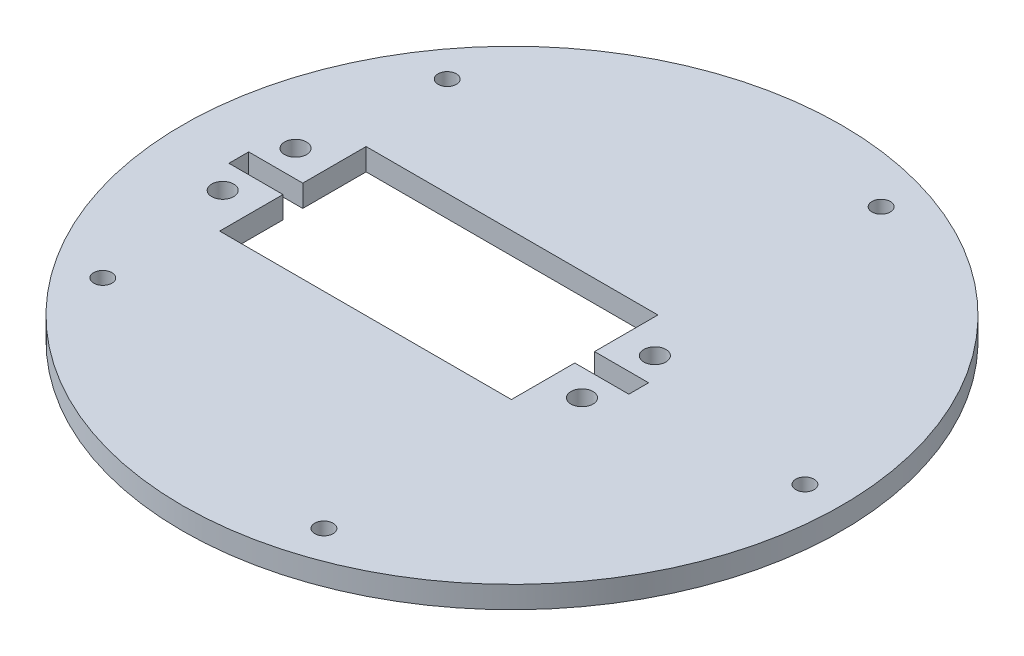
ISO-10303-21;
HEADER;
FILE_DESCRIPTION(('STEP AP214'),'2;1');
FILE_NAME('part.step','',(''),(''),'','','');
FILE_SCHEMA(('AUTOMOTIVE_DESIGN { 1 0 10303 214 1 1 1 1 }'));
ENDSEC;
DATA;
#1=APPLICATION_CONTEXT('core data for automotive mechanical design processes');
#2=APPLICATION_PROTOCOL_DEFINITION('international standard','automotive_design',2000,#1);
#3=PRODUCT_CONTEXT('',#1,'mechanical');
#4=PRODUCT('Part','Part','',(#3));
#5=PRODUCT_RELATED_PRODUCT_CATEGORY('part','',(#4));
#6=PRODUCT_DEFINITION_FORMATION('','',#4);
#7=PRODUCT_DEFINITION_CONTEXT('part definition',#1,'design');
#8=PRODUCT_DEFINITION('design','',#6,#7);
#9=PRODUCT_DEFINITION_SHAPE('','',#8);
#10=(LENGTH_UNIT() NAMED_UNIT(*) SI_UNIT(.MILLI.,.METRE.));
#11=(NAMED_UNIT(*) PLANE_ANGLE_UNIT() SI_UNIT($,.RADIAN.));
#12=(NAMED_UNIT(*) SI_UNIT($,.STERADIAN.) SOLID_ANGLE_UNIT());
#13=UNCERTAINTY_MEASURE_WITH_UNIT(LENGTH_MEASURE(1.E-05),#10,'distance_accuracy_value','');
#14=(GEOMETRIC_REPRESENTATION_CONTEXT(3) GLOBAL_UNCERTAINTY_ASSIGNED_CONTEXT((#13)) GLOBAL_UNIT_ASSIGNED_CONTEXT((#10,
#11,#12)) REPRESENTATION_CONTEXT('',''));
#15=CARTESIAN_POINT('',(0.,0.,0.));
#16=DIRECTION('',(0.,0.,1.));
#17=DIRECTION('',(1.,0.,0.));
#18=AXIS2_PLACEMENT_3D('',#15,#16,#17);
#19=CARTESIAN_POINT('',(0.,3.,0.));
#20=DIRECTION('',(0.,1.,0.));
#21=DIRECTION('',(0.,0.,1.));
#22=AXIS2_PLACEMENT_3D('',#19,#20,#21);
#23=PLANE('',#22);
#24=CARTESIAN_POINT('',(14.53,3.,-4.975));
#25=DIRECTION('',(0.,1.,0.));
#26=DIRECTION('',(0.,0.,1.));
#27=AXIS2_PLACEMENT_3D('',#24,#25,#26);
#28=CIRCLE('',#27,1.5);
#29=CARTESIAN_POINT('',(14.53,3.,-3.475));
#30=VERTEX_POINT('',#29);
#31=EDGE_CURVE('E249',#30,#30,#28,.T.);
#32=ORIENTED_EDGE('',*,*,#31,.F.);
#33=EDGE_LOOP('',(#32));
#34=FACE_BOUND('',#33,.T.);
#35=CARTESIAN_POINT('',(-34.53,3.,-4.975));
#36=DIRECTION('',(0.,1.,0.));
#37=DIRECTION('',(0.,0.,1.));
#38=AXIS2_PLACEMENT_3D('',#35,#36,#37);
#39=CIRCLE('',#38,1.5);
#40=CARTESIAN_POINT('',(-34.53,3.,-3.475));
#41=VERTEX_POINT('',#40);
#42=EDGE_CURVE('E248',#41,#41,#39,.T.);
#43=ORIENTED_EDGE('',*,*,#42,.F.);
#44=EDGE_LOOP('',(#43));
#45=FACE_BOUND('',#44,.T.);
#46=DIRECTION('',(1.,0.,0.));
#47=VECTOR('',#46,1.);
#48=CARTESIAN_POINT('',(9.91999999999999,3.,1.35));
#49=LINE('',#48,#47);
#50=CARTESIAN_POINT('',(9.91999999999999,3.,1.35));
#51=VERTEX_POINT('',#50);
#52=CARTESIAN_POINT('',(17.305,3.,1.35));
#53=VERTEX_POINT('',#52);
#54=EDGE_CURVE('E225',#51,#53,#49,.T.);
#55=ORIENTED_EDGE('',*,*,#54,.F.);
#56=DIRECTION('',(0.,0.,1.));
#57=VECTOR('',#56,1.);
#58=CARTESIAN_POINT('',(9.91999999999999,3.,-10.));
#59=LINE('',#58,#57);
#60=CARTESIAN_POINT('',(9.91999999999999,3.,10.));
#61=VERTEX_POINT('',#60);
#62=EDGE_CURVE('E241',#51,#61,#59,.T.);
#63=ORIENTED_EDGE('',*,*,#62,.T.);
#64=DIRECTION('',(1.,0.,0.));
#65=VECTOR('',#64,1.);
#66=CARTESIAN_POINT('',(-29.92,3.,10.));
#67=LINE('',#66,#65);
#68=CARTESIAN_POINT('',(-29.92,3.,10.));
#69=VERTEX_POINT('',#68);
#70=EDGE_CURVE('E242',#69,#61,#67,.T.);
#71=ORIENTED_EDGE('',*,*,#70,.F.);
#72=DIRECTION('',(0.,0.,1.));
#73=VECTOR('',#72,1.);
#74=CARTESIAN_POINT('',(-29.92,3.,-10.));
#75=LINE('',#74,#73);
#76=CARTESIAN_POINT('',(-29.92,3.,1.35000000000001));
#77=VERTEX_POINT('',#76);
#78=EDGE_CURVE('E217',#77,#69,#75,.T.);
#79=ORIENTED_EDGE('',*,*,#78,.F.);
#80=DIRECTION('',(-1.,0.,0.));
#81=VECTOR('',#80,1.);
#82=CARTESIAN_POINT('',(-29.92,3.,1.35000000000001));
#83=LINE('',#82,#81);
#84=CARTESIAN_POINT('',(-37.305,3.,1.35000000000001));
#85=VERTEX_POINT('',#84);
#86=EDGE_CURVE('E202',#77,#85,#83,.T.);
#87=ORIENTED_EDGE('',*,*,#86,.T.);
#88=DIRECTION('',(0.,0.,1.));
#89=VECTOR('',#88,1.);
#90=CARTESIAN_POINT('',(-37.305,3.,-1.34999999999999));
#91=LINE('',#90,#89);
#92=CARTESIAN_POINT('',(-37.305,3.,-1.34999999999999));
#93=VERTEX_POINT('',#92);
#94=EDGE_CURVE('E185',#93,#85,#91,.T.);
#95=ORIENTED_EDGE('',*,*,#94,.F.);
#96=DIRECTION('',(-1.,0.,0.));
#97=VECTOR('',#96,1.);
#98=CARTESIAN_POINT('',(-29.92,3.,-1.34999999999999));
#99=LINE('',#98,#97);
#100=CARTESIAN_POINT('',(-29.92,3.,-1.34999999999999));
#101=VERTEX_POINT('',#100);
#102=EDGE_CURVE('E190',#101,#93,#99,.T.);
#103=ORIENTED_EDGE('',*,*,#102,.F.);
#104=CARTESIAN_POINT('',(-29.92,3.,-10.));
#105=VERTEX_POINT('',#104);
#106=EDGE_CURVE('E108',#105,#101,#75,.T.);
#107=ORIENTED_EDGE('',*,*,#106,.F.);
#108=DIRECTION('',(1.,0.,0.));
#109=VECTOR('',#108,1.);
#110=CARTESIAN_POINT('',(-29.92,3.,-10.));
#111=LINE('',#110,#109);
#112=CARTESIAN_POINT('',(9.91999999999999,3.,-10.));
#113=VERTEX_POINT('',#112);
#114=EDGE_CURVE('E230',#105,#113,#111,.T.);
#115=ORIENTED_EDGE('',*,*,#114,.T.);
#116=CARTESIAN_POINT('',(9.91999999999999,3.,-1.35));
#117=VERTEX_POINT('',#116);
#118=EDGE_CURVE('E238',#113,#117,#59,.T.);
#119=ORIENTED_EDGE('',*,*,#118,.T.);
#120=DIRECTION('',(1.,0.,0.));
#121=VECTOR('',#120,1.);
#122=CARTESIAN_POINT('',(9.91999999999999,3.,-1.35));
#123=LINE('',#122,#121);
#124=CARTESIAN_POINT('',(17.305,3.,-1.35));
#125=VERTEX_POINT('',#124);
#126=EDGE_CURVE('E214',#117,#125,#123,.T.);
#127=ORIENTED_EDGE('',*,*,#126,.T.);
#128=DIRECTION('',(0.,0.,1.));
#129=VECTOR('',#128,1.);
#130=CARTESIAN_POINT('',(17.305,3.,-1.35));
#131=LINE('',#130,#129);
#132=EDGE_CURVE('E222',#125,#53,#131,.T.);
#133=ORIENTED_EDGE('',*,*,#132,.T.);
#134=EDGE_LOOP('',(#55,#63,#71,#79,#87,#95,#103,#107,#115,#119,#127,#133));
#135=FACE_BOUND('',#134,.T.);
#136=CARTESIAN_POINT('',(-34.53,3.,4.975));
#137=DIRECTION('',(0.,1.,0.));
#138=DIRECTION('',(0.,0.,1.));
#139=AXIS2_PLACEMENT_3D('',#136,#137,#138);
#140=CIRCLE('',#139,1.5);
#141=CARTESIAN_POINT('',(-34.53,3.,6.47500000000001));
#142=VERTEX_POINT('',#141);
#143=EDGE_CURVE('E204',#142,#142,#140,.T.);
#144=ORIENTED_EDGE('',*,*,#143,.F.);
#145=EDGE_LOOP('',(#144));
#146=FACE_BOUND('',#145,.T.);
#147=CARTESIAN_POINT('',(14.53,3.,4.975));
#148=DIRECTION('',(0.,1.,0.));
#149=DIRECTION('',(0.,0.,1.));
#150=AXIS2_PLACEMENT_3D('',#147,#148,#149);
#151=CIRCLE('',#150,1.5);
#152=CARTESIAN_POINT('',(14.53,3.,6.475));
#153=VERTEX_POINT('',#152);
#154=EDGE_CURVE('E252',#153,#153,#151,.T.);
#155=ORIENTED_EDGE('',*,*,#154,.F.);
#156=EDGE_LOOP('',(#155));
#157=FACE_BOUND('',#156,.T.);
#158=CARTESIAN_POINT('',(40.,3.,0.));
#159=DIRECTION('',(0.,-1.,0.));
#160=DIRECTION('',(0.,0.,-1.));
#161=AXIS2_PLACEMENT_3D('',#158,#159,#160);
#162=CIRCLE('',#161,1.24999999999999);
#163=CARTESIAN_POINT('',(40.,3.,-1.24999999999999));
#164=VERTEX_POINT('',#163);
#165=EDGE_CURVE('E264',#164,#164,#162,.T.);
#166=ORIENTED_EDGE('',*,*,#165,.T.);
#167=EDGE_LOOP('',(#166));
#168=FACE_BOUND('',#167,.T.);
#169=CARTESIAN_POINT('',(12.3606797749979,3.,38.0422606518061));
#170=DIRECTION('',(0.,-1.,0.));
#171=DIRECTION('',(0.,0.,-1.));
#172=AXIS2_PLACEMENT_3D('',#169,#170,#171);
#173=CIRCLE('',#172,1.24999999999999);
#174=CARTESIAN_POINT('',(12.3606797749979,3.,36.7922606518062));
#175=VERTEX_POINT('',#174);
#176=EDGE_CURVE('E273',#175,#175,#173,.T.);
#177=ORIENTED_EDGE('',*,*,#176,.T.);
#178=EDGE_LOOP('',(#177));
#179=FACE_BOUND('',#178,.T.);
#180=CARTESIAN_POINT('',(0.,3.,0.));
#181=DIRECTION('',(0.,1.,0.));
#182=DIRECTION('',(0.,0.,1.));
#183=AXIS2_PLACEMENT_3D('',#180,#181,#182);
#184=CIRCLE('',#183,45.);
#185=CARTESIAN_POINT('',(0.,3.,45.));
#186=VERTEX_POINT('',#185);
#187=EDGE_CURVE('E304',#186,#186,#184,.T.);
#188=ORIENTED_EDGE('',*,*,#187,.T.);
#189=EDGE_LOOP('',(#188));
#190=FACE_BOUND('',#189,.T.);
#191=CARTESIAN_POINT('',(12.3606797749979,3.,-38.0422606518061));
#192=DIRECTION('',(0.,-1.,0.));
#193=DIRECTION('',(0.,0.,-1.));
#194=AXIS2_PLACEMENT_3D('',#191,#192,#193);
#195=CIRCLE('',#194,1.24999999999999);
#196=CARTESIAN_POINT('',(12.3606797749979,3.,-39.2922606518061));
#197=VERTEX_POINT('',#196);
#198=EDGE_CURVE('E300',#197,#197,#195,.T.);
#199=ORIENTED_EDGE('',*,*,#198,.T.);
#200=EDGE_LOOP('',(#199));
#201=FACE_BOUND('',#200,.T.);
#202=CARTESIAN_POINT('',(-32.3606797749979,3.,-23.5114100916989));
#203=DIRECTION('',(0.,-1.,0.));
#204=DIRECTION('',(0.,0.,-1.));
#205=AXIS2_PLACEMENT_3D('',#202,#203,#204);
#206=CIRCLE('',#205,1.24999999999999);
#207=CARTESIAN_POINT('',(-32.3606797749979,3.,-24.7614100916989));
#208=VERTEX_POINT('',#207);
#209=EDGE_CURVE('E291',#208,#208,#206,.T.);
#210=ORIENTED_EDGE('',*,*,#209,.T.);
#211=EDGE_LOOP('',(#210));
#212=FACE_BOUND('',#211,.T.);
#213=CARTESIAN_POINT('',(-32.3606797749979,3.,23.5114100916989));
#214=DIRECTION('',(0.,-1.,0.));
#215=DIRECTION('',(0.,0.,-1.));
#216=AXIS2_PLACEMENT_3D('',#213,#214,#215);
#217=CIRCLE('',#216,1.24999999999999);
#218=CARTESIAN_POINT('',(-32.3606797749979,3.,22.2614100916989));
#219=VERTEX_POINT('',#218);
#220=EDGE_CURVE('E282',#219,#219,#217,.T.);
#221=ORIENTED_EDGE('',*,*,#220,.T.);
#222=EDGE_LOOP('',(#221));
#223=FACE_BOUND('',#222,.T.);
#224=ADVANCED_FACE('F91',(#34,#45,#135,#146,#157,#168,#179,#190,#201,#212,#223),#23,.T.);
#225=CARTESIAN_POINT('',(0.,3.,0.));
#226=DIRECTION('',(0.,-1.,0.));
#227=DIRECTION('',(0.,0.,-1.));
#228=AXIS2_PLACEMENT_3D('',#225,#226,#227);
#229=CYLINDRICAL_SURFACE('',#228,45.);
#230=ORIENTED_EDGE('',*,*,#187,.F.);
#231=EDGE_LOOP('',(#230));
#232=FACE_BOUND('',#231,.T.);
#233=CARTESIAN_POINT('',(0.,0.,0.));
#234=DIRECTION('',(0.,1.,0.));
#235=DIRECTION('',(0.,0.,1.));
#236=AXIS2_PLACEMENT_3D('',#233,#234,#235);
#237=CIRCLE('',#236,45.);
#238=CARTESIAN_POINT('',(0.,0.,45.));
#239=VERTEX_POINT('',#238);
#240=EDGE_CURVE('E303',#239,#239,#237,.T.);
#241=ORIENTED_EDGE('',*,*,#240,.T.);
#242=EDGE_LOOP('',(#241));
#243=FACE_BOUND('',#242,.T.);
#244=ADVANCED_FACE('F93',(#232,#243),#229,.T.);
#245=CARTESIAN_POINT('',(0.,0.,0.));
#246=DIRECTION('',(0.,1.,0.));
#247=DIRECTION('',(0.,0.,1.));
#248=AXIS2_PLACEMENT_3D('',#245,#246,#247);
#249=PLANE('',#248);
#250=CARTESIAN_POINT('',(14.53,0.,-4.975));
#251=DIRECTION('',(0.,1.,0.));
#252=DIRECTION('',(0.,0.,1.));
#253=AXIS2_PLACEMENT_3D('',#250,#251,#252);
#254=CIRCLE('',#253,1.5);
#255=CARTESIAN_POINT('',(14.53,0.,-3.475));
#256=VERTEX_POINT('',#255);
#257=EDGE_CURVE('E95',#256,#256,#254,.T.);
#258=ORIENTED_EDGE('',*,*,#257,.T.);
#259=EDGE_LOOP('',(#258));
#260=FACE_BOUND('',#259,.T.);
#261=CARTESIAN_POINT('',(-34.53,0.,-4.975));
#262=DIRECTION('',(0.,1.,0.));
#263=DIRECTION('',(0.,0.,1.));
#264=AXIS2_PLACEMENT_3D('',#261,#262,#263);
#265=CIRCLE('',#264,1.5);
#266=CARTESIAN_POINT('',(-34.53,0.,-3.475));
#267=VERTEX_POINT('',#266);
#268=EDGE_CURVE('E315',#267,#267,#265,.T.);
#269=ORIENTED_EDGE('',*,*,#268,.T.);
#270=EDGE_LOOP('',(#269));
#271=FACE_BOUND('',#270,.T.);
#272=DIRECTION('',(0.,0.,1.));
#273=VECTOR('',#272,1.);
#274=CARTESIAN_POINT('',(9.91999999999999,0.,0.));
#275=LINE('',#274,#273);
#276=CARTESIAN_POINT('',(9.91999999999999,0.,1.35));
#277=VERTEX_POINT('',#276);
#278=CARTESIAN_POINT('',(9.91999999999999,0.,10.));
#279=VERTEX_POINT('',#278);
#280=EDGE_CURVE('E100',#277,#279,#275,.T.);
#281=ORIENTED_EDGE('',*,*,#280,.F.);
#282=DIRECTION('',(1.,0.,0.));
#283=VECTOR('',#282,1.);
#284=CARTESIAN_POINT('',(0.,0.,1.35));
#285=LINE('',#284,#283);
#286=CARTESIAN_POINT('',(17.305,0.,1.35));
#287=VERTEX_POINT('',#286);
#288=EDGE_CURVE('E12',#277,#287,#285,.T.);
#289=ORIENTED_EDGE('',*,*,#288,.T.);
#290=DIRECTION('',(0.,0.,1.));
#291=VECTOR('',#290,1.);
#292=CARTESIAN_POINT('',(17.305,0.,0.));
#293=LINE('',#292,#291);
#294=CARTESIAN_POINT('',(17.305,0.,-1.35));
#295=VERTEX_POINT('',#294);
#296=EDGE_CURVE('E335',#295,#287,#293,.T.);
#297=ORIENTED_EDGE('',*,*,#296,.F.);
#298=DIRECTION('',(1.,0.,0.));
#299=VECTOR('',#298,1.);
#300=CARTESIAN_POINT('',(0.,0.,-1.35));
#301=LINE('',#300,#299);
#302=CARTESIAN_POINT('',(9.91999999999999,0.,-1.35));
#303=VERTEX_POINT('',#302);
#304=EDGE_CURVE('E333',#303,#295,#301,.T.);
#305=ORIENTED_EDGE('',*,*,#304,.F.);
#306=DIRECTION('',(0.,0.,1.));
#307=VECTOR('',#306,1.);
#308=CARTESIAN_POINT('',(9.91999999999999,0.,0.));
#309=LINE('',#308,#307);
#310=CARTESIAN_POINT('',(9.91999999999999,0.,-10.));
#311=VERTEX_POINT('',#310);
#312=EDGE_CURVE('E328',#311,#303,#309,.T.);
#313=ORIENTED_EDGE('',*,*,#312,.F.);
#314=DIRECTION('',(1.,0.,0.));
#315=VECTOR('',#314,1.);
#316=CARTESIAN_POINT('',(0.,0.,-10.));
#317=LINE('',#316,#315);
#318=CARTESIAN_POINT('',(-29.92,0.,-10.));
#319=VERTEX_POINT('',#318);
#320=EDGE_CURVE('E321',#319,#311,#317,.T.);
#321=ORIENTED_EDGE('',*,*,#320,.F.);
#322=DIRECTION('',(0.,0.,1.));
#323=VECTOR('',#322,1.);
#324=CARTESIAN_POINT('',(-29.92,0.,0.));
#325=LINE('',#324,#323);
#326=CARTESIAN_POINT('',(-29.92,0.,-1.34999999999999));
#327=VERTEX_POINT('',#326);
#328=EDGE_CURVE('E318',#319,#327,#325,.T.);
#329=ORIENTED_EDGE('',*,*,#328,.T.);
#330=DIRECTION('',(-1.,0.,0.));
#331=VECTOR('',#330,1.);
#332=CARTESIAN_POINT('',(0.,0.,-1.35));
#333=LINE('',#332,#331);
#334=CARTESIAN_POINT('',(-37.305,0.,-1.34999999999999));
#335=VERTEX_POINT('',#334);
#336=EDGE_CURVE('E307',#327,#335,#333,.T.);
#337=ORIENTED_EDGE('',*,*,#336,.T.);
#338=DIRECTION('',(0.,0.,1.));
#339=VECTOR('',#338,1.);
#340=CARTESIAN_POINT('',(-37.305,0.,0.));
#341=LINE('',#340,#339);
#342=CARTESIAN_POINT('',(-37.305,0.,1.35000000000001));
#343=VERTEX_POINT('',#342);
#344=EDGE_CURVE('E188',#335,#343,#341,.T.);
#345=ORIENTED_EDGE('',*,*,#344,.T.);
#346=DIRECTION('',(-1.,0.,0.));
#347=VECTOR('',#346,1.);
#348=CARTESIAN_POINT('',(0.,0.,1.35));
#349=LINE('',#348,#347);
#350=CARTESIAN_POINT('',(-29.92,0.,1.35000000000001));
#351=VERTEX_POINT('',#350);
#352=EDGE_CURVE('E323',#351,#343,#349,.T.);
#353=ORIENTED_EDGE('',*,*,#352,.F.);
#354=DIRECTION('',(0.,0.,1.));
#355=VECTOR('',#354,1.);
#356=CARTESIAN_POINT('',(-29.92,0.,0.));
#357=LINE('',#356,#355);
#358=CARTESIAN_POINT('',(-29.92,0.,10.));
#359=VERTEX_POINT('',#358);
#360=EDGE_CURVE('E325',#351,#359,#357,.T.);
#361=ORIENTED_EDGE('',*,*,#360,.T.);
#362=DIRECTION('',(1.,0.,0.));
#363=VECTOR('',#362,1.);
#364=CARTESIAN_POINT('',(0.,0.,10.));
#365=LINE('',#364,#363);
#366=EDGE_CURVE('E330',#359,#279,#365,.T.);
#367=ORIENTED_EDGE('',*,*,#366,.T.);
#368=EDGE_LOOP('',(#281,#289,#297,#305,#313,#321,#329,#337,#345,#353,#361,#367));
#369=FACE_BOUND('',#368,.T.);
#370=CARTESIAN_POINT('',(-34.53,0.,4.975));
#371=DIRECTION('',(0.,1.,0.));
#372=DIRECTION('',(0.,0.,1.));
#373=AXIS2_PLACEMENT_3D('',#370,#371,#372);
#374=CIRCLE('',#373,1.5);
#375=CARTESIAN_POINT('',(-34.53,0.,6.47500000000001));
#376=VERTEX_POINT('',#375);
#377=EDGE_CURVE('E312',#376,#376,#374,.T.);
#378=ORIENTED_EDGE('',*,*,#377,.T.);
#379=EDGE_LOOP('',(#378));
#380=FACE_BOUND('',#379,.T.);
#381=CARTESIAN_POINT('',(14.53,0.,4.975));
#382=DIRECTION('',(0.,1.,0.));
#383=DIRECTION('',(0.,0.,1.));
#384=AXIS2_PLACEMENT_3D('',#381,#382,#383);
#385=CIRCLE('',#384,1.5);
#386=CARTESIAN_POINT('',(14.53,0.,6.475));
#387=VERTEX_POINT('',#386);
#388=EDGE_CURVE('E257',#387,#387,#385,.T.);
#389=ORIENTED_EDGE('',*,*,#388,.T.);
#390=EDGE_LOOP('',(#389));
#391=FACE_BOUND('',#390,.T.);
#392=CARTESIAN_POINT('',(40.,0.,0.));
#393=DIRECTION('',(0.,-1.,0.));
#394=DIRECTION('',(0.,0.,-1.));
#395=AXIS2_PLACEMENT_3D('',#392,#393,#394);
#396=CIRCLE('',#395,1.275);
#397=CARTESIAN_POINT('',(40.,0.,-1.275));
#398=VERTEX_POINT('',#397);
#399=EDGE_CURVE('E258',#398,#398,#396,.T.);
#400=ORIENTED_EDGE('',*,*,#399,.F.);
#401=EDGE_LOOP('',(#400));
#402=FACE_BOUND('',#401,.T.);
#403=CARTESIAN_POINT('',(12.3606797749979,0.,38.0422606518061));
#404=DIRECTION('',(0.,-1.,0.));
#405=DIRECTION('',(0.,0.,-1.));
#406=AXIS2_PLACEMENT_3D('',#403,#404,#405);
#407=CIRCLE('',#406,1.275);
#408=CARTESIAN_POINT('',(12.3606797749979,0.,36.7672606518061));
#409=VERTEX_POINT('',#408);
#410=EDGE_CURVE('E267',#409,#409,#407,.T.);
#411=ORIENTED_EDGE('',*,*,#410,.F.);
#412=EDGE_LOOP('',(#411));
#413=FACE_BOUND('',#412,.T.);
#414=CARTESIAN_POINT('',(-32.3606797749979,0.,23.5114100916989));
#415=DIRECTION('',(0.,-1.,0.));
#416=DIRECTION('',(0.,0.,-1.));
#417=AXIS2_PLACEMENT_3D('',#414,#415,#416);
#418=CIRCLE('',#417,1.275);
#419=CARTESIAN_POINT('',(-32.3606797749979,0.,22.2364100916989));
#420=VERTEX_POINT('',#419);
#421=EDGE_CURVE('E276',#420,#420,#418,.T.);
#422=ORIENTED_EDGE('',*,*,#421,.F.);
#423=EDGE_LOOP('',(#422));
#424=FACE_BOUND('',#423,.T.);
#425=CARTESIAN_POINT('',(-32.3606797749979,0.,-23.5114100916989));
#426=DIRECTION('',(0.,-1.,0.));
#427=DIRECTION('',(0.,0.,-1.));
#428=AXIS2_PLACEMENT_3D('',#425,#426,#427);
#429=CIRCLE('',#428,1.275);
#430=CARTESIAN_POINT('',(-32.3606797749979,0.,-24.7864100916989));
#431=VERTEX_POINT('',#430);
#432=EDGE_CURVE('E285',#431,#431,#429,.T.);
#433=ORIENTED_EDGE('',*,*,#432,.F.);
#434=EDGE_LOOP('',(#433));
#435=FACE_BOUND('',#434,.T.);
#436=CARTESIAN_POINT('',(12.3606797749979,0.,-38.0422606518061));
#437=DIRECTION('',(0.,-1.,0.));
#438=DIRECTION('',(0.,0.,-1.));
#439=AXIS2_PLACEMENT_3D('',#436,#437,#438);
#440=CIRCLE('',#439,1.275);
#441=CARTESIAN_POINT('',(12.3606797749979,0.,-39.3172606518061));
#442=VERTEX_POINT('',#441);
#443=EDGE_CURVE('E294',#442,#442,#440,.T.);
#444=ORIENTED_EDGE('',*,*,#443,.F.);
#445=EDGE_LOOP('',(#444));
#446=FACE_BOUND('',#445,.T.);
#447=ORIENTED_EDGE('',*,*,#240,.F.);
#448=EDGE_LOOP('',(#447));
#449=FACE_BOUND('',#448,.T.);
#450=ADVANCED_FACE('F343',(#260,#271,#369,#380,#391,#402,#413,#424,#435,#446,#449),#249,.F.);
#451=CARTESIAN_POINT('',(12.3606797749979,0.,-38.0422606518061));
#452=DIRECTION('',(0.,-1.,0.));
#453=DIRECTION('',(0.,0.,-1.));
#454=AXIS2_PLACEMENT_3D('',#451,#452,#453);
#455=CYLINDRICAL_SURFACE('',#454,1.24999999999999);
#456=ORIENTED_EDGE('',*,*,#198,.F.);
#457=EDGE_LOOP('',(#456));
#458=FACE_BOUND('',#457,.T.);
#459=CARTESIAN_POINT('',(12.3606797749979,0.025000000000025,-38.0422606518061));
#460=DIRECTION('',(0.,-1.,0.));
#461=DIRECTION('',(0.,0.,-1.));
#462=AXIS2_PLACEMENT_3D('',#459,#460,#461);
#463=CIRCLE('',#462,1.24999999999999);
#464=CARTESIAN_POINT('',(12.3606797749979,0.025000000000025,-39.2922606518061));
#465=VERTEX_POINT('',#464);
#466=EDGE_CURVE('E297',#465,#465,#463,.T.);
#467=ORIENTED_EDGE('',*,*,#466,.T.);
#468=EDGE_LOOP('',(#467));
#469=FACE_BOUND('',#468,.T.);
#470=ADVANCED_FACE('F368',(#458,#469),#455,.F.);
#471=CARTESIAN_POINT('',(12.3606797749979,0.,-38.0422606518061));
#472=DIRECTION('',(0.,-1.,0.));
#473=DIRECTION('',(0.,0.,-1.));
#474=AXIS2_PLACEMENT_3D('',#471,#472,#473);
#475=CONICAL_SURFACE('',#474,1.275,0.785398163397171);
#476=ORIENTED_EDGE('',*,*,#466,.F.);
#477=EDGE_LOOP('',(#476));
#478=FACE_BOUND('',#477,.T.);
#479=ORIENTED_EDGE('',*,*,#443,.T.);
#480=EDGE_LOOP('',(#479));
#481=FACE_BOUND('',#480,.T.);
#482=ADVANCED_FACE('F374',(#478,#481),#475,.F.);
#483=CARTESIAN_POINT('',(-32.3606797749979,0.,-23.5114100916989));
#484=DIRECTION('',(0.,-1.,0.));
#485=DIRECTION('',(0.,0.,-1.));
#486=AXIS2_PLACEMENT_3D('',#483,#484,#485);
#487=CYLINDRICAL_SURFACE('',#486,1.24999999999999);
#488=ORIENTED_EDGE('',*,*,#209,.F.);
#489=EDGE_LOOP('',(#488));
#490=FACE_BOUND('',#489,.T.);
#491=CARTESIAN_POINT('',(-32.3606797749979,0.025000000000025,-23.5114100916989));
#492=DIRECTION('',(0.,-1.,0.));
#493=DIRECTION('',(0.,0.,-1.));
#494=AXIS2_PLACEMENT_3D('',#491,#492,#493);
#495=CIRCLE('',#494,1.24999999999999);
#496=CARTESIAN_POINT('',(-32.3606797749979,0.025000000000025,-24.7614100916989));
#497=VERTEX_POINT('',#496);
#498=EDGE_CURVE('E288',#497,#497,#495,.T.);
#499=ORIENTED_EDGE('',*,*,#498,.T.);
#500=EDGE_LOOP('',(#499));
#501=FACE_BOUND('',#500,.T.);
#502=ADVANCED_FACE('F380',(#490,#501),#487,.F.);
#503=CARTESIAN_POINT('',(-32.3606797749979,0.,-23.5114100916989));
#504=DIRECTION('',(0.,-1.,0.));
#505=DIRECTION('',(0.,0.,-1.));
#506=AXIS2_PLACEMENT_3D('',#503,#504,#505);
#507=CONICAL_SURFACE('',#506,1.275,0.785398163397136);
#508=ORIENTED_EDGE('',*,*,#498,.F.);
#509=EDGE_LOOP('',(#508));
#510=FACE_BOUND('',#509,.T.);
#511=ORIENTED_EDGE('',*,*,#432,.T.);
#512=EDGE_LOOP('',(#511));
#513=FACE_BOUND('',#512,.T.);
#514=ADVANCED_FACE('F401',(#510,#513),#507,.F.);
#515=CARTESIAN_POINT('',(-32.3606797749979,0.,23.5114100916989));
#516=DIRECTION('',(0.,-1.,0.));
#517=DIRECTION('',(0.,0.,-1.));
#518=AXIS2_PLACEMENT_3D('',#515,#516,#517);
#519=CYLINDRICAL_SURFACE('',#518,1.24999999999999);
#520=ORIENTED_EDGE('',*,*,#220,.F.);
#521=EDGE_LOOP('',(#520));
#522=FACE_BOUND('',#521,.T.);
#523=CARTESIAN_POINT('',(-32.3606797749979,0.025000000000025,23.5114100916989));
#524=DIRECTION('',(0.,-1.,0.));
#525=DIRECTION('',(0.,0.,-1.));
#526=AXIS2_PLACEMENT_3D('',#523,#524,#525);
#527=CIRCLE('',#526,1.24999999999999);
#528=CARTESIAN_POINT('',(-32.3606797749979,0.025000000000025,22.2614100916989));
#529=VERTEX_POINT('',#528);
#530=EDGE_CURVE('E279',#529,#529,#527,.T.);
#531=ORIENTED_EDGE('',*,*,#530,.T.);
#532=EDGE_LOOP('',(#531));
#533=FACE_BOUND('',#532,.T.);
#534=ADVANCED_FACE('F397',(#522,#533),#519,.F.);
#535=CARTESIAN_POINT('',(-32.3606797749979,0.,23.5114100916989));
#536=DIRECTION('',(0.,-1.,0.));
#537=DIRECTION('',(0.,0.,-1.));
#538=AXIS2_PLACEMENT_3D('',#535,#536,#537);
#539=CONICAL_SURFACE('',#538,1.275,0.785398163397136);
#540=ORIENTED_EDGE('',*,*,#530,.F.);
#541=EDGE_LOOP('',(#540));
#542=FACE_BOUND('',#541,.T.);
#543=ORIENTED_EDGE('',*,*,#421,.T.);
#544=EDGE_LOOP('',(#543));
#545=FACE_BOUND('',#544,.T.);
#546=ADVANCED_FACE('F400',(#542,#545),#539,.F.);
#547=CARTESIAN_POINT('',(12.3606797749979,0.,38.0422606518061));
#548=DIRECTION('',(0.,-1.,0.));
#549=DIRECTION('',(0.,0.,-1.));
#550=AXIS2_PLACEMENT_3D('',#547,#548,#549);
#551=CYLINDRICAL_SURFACE('',#550,1.24999999999999);
#552=ORIENTED_EDGE('',*,*,#176,.F.);
#553=EDGE_LOOP('',(#552));
#554=FACE_BOUND('',#553,.T.);
#555=CARTESIAN_POINT('',(12.3606797749979,0.025000000000025,38.0422606518061));
#556=DIRECTION('',(0.,-1.,0.));
#557=DIRECTION('',(0.,0.,-1.));
#558=AXIS2_PLACEMENT_3D('',#555,#556,#557);
#559=CIRCLE('',#558,1.24999999999999);
#560=CARTESIAN_POINT('',(12.3606797749979,0.025000000000025,36.7922606518062));
#561=VERTEX_POINT('',#560);
#562=EDGE_CURVE('E270',#561,#561,#559,.T.);
#563=ORIENTED_EDGE('',*,*,#562,.T.);
#564=EDGE_LOOP('',(#563));
#565=FACE_BOUND('',#564,.T.);
#566=ADVANCED_FACE('F407',(#554,#565),#551,.F.);
#567=CARTESIAN_POINT('',(12.3606797749979,0.,38.0422606518061));
#568=DIRECTION('',(0.,-1.,0.));
#569=DIRECTION('',(0.,0.,-1.));
#570=AXIS2_PLACEMENT_3D('',#567,#568,#569);
#571=CONICAL_SURFACE('',#570,1.275,0.785398163397171);
#572=ORIENTED_EDGE('',*,*,#562,.F.);
#573=EDGE_LOOP('',(#572));
#574=FACE_BOUND('',#573,.T.);
#575=ORIENTED_EDGE('',*,*,#410,.T.);
#576=EDGE_LOOP('',(#575));
#577=FACE_BOUND('',#576,.T.);
#578=ADVANCED_FACE('F426',(#574,#577),#571,.F.);
#579=CARTESIAN_POINT('',(40.,0.,0.));
#580=DIRECTION('',(0.,-1.,0.));
#581=DIRECTION('',(0.,0.,-1.));
#582=AXIS2_PLACEMENT_3D('',#579,#580,#581);
#583=CYLINDRICAL_SURFACE('',#582,1.24999999999999);
#584=ORIENTED_EDGE('',*,*,#165,.F.);
#585=EDGE_LOOP('',(#584));
#586=FACE_BOUND('',#585,.T.);
#587=CARTESIAN_POINT('',(40.,0.025000000000025,0.));
#588=DIRECTION('',(0.,-1.,0.));
#589=DIRECTION('',(0.,0.,-1.));
#590=AXIS2_PLACEMENT_3D('',#587,#588,#589);
#591=CIRCLE('',#590,1.24999999999999);
#592=CARTESIAN_POINT('',(40.,0.025000000000025,-1.24999999999999));
#593=VERTEX_POINT('',#592);
#594=EDGE_CURVE('E261',#593,#593,#591,.T.);
#595=ORIENTED_EDGE('',*,*,#594,.T.);
#596=EDGE_LOOP('',(#595));
#597=FACE_BOUND('',#596,.T.);
#598=ADVANCED_FACE('F430',(#586,#597),#583,.F.);
#599=CARTESIAN_POINT('',(40.,0.,0.));
#600=DIRECTION('',(0.,-1.,0.));
#601=DIRECTION('',(0.,0.,-1.));
#602=AXIS2_PLACEMENT_3D('',#599,#600,#601);
#603=CONICAL_SURFACE('',#602,1.275,0.785398163397136);
#604=ORIENTED_EDGE('',*,*,#594,.F.);
#605=EDGE_LOOP('',(#604));
#606=FACE_BOUND('',#605,.T.);
#607=ORIENTED_EDGE('',*,*,#399,.T.);
#608=EDGE_LOOP('',(#607));
#609=FACE_BOUND('',#608,.T.);
#610=ADVANCED_FACE('F434',(#606,#609),#603,.F.);
#611=CARTESIAN_POINT('',(14.53,-1.2E-05,4.975));
#612=DIRECTION('',(0.,1.,0.));
#613=DIRECTION('',(0.,0.,1.));
#614=AXIS2_PLACEMENT_3D('',#611,#612,#613);
#615=CYLINDRICAL_SURFACE('',#614,1.5);
#616=ORIENTED_EDGE('',*,*,#154,.T.);
#617=EDGE_LOOP('',(#616));
#618=FACE_BOUND('',#617,.T.);
#619=ORIENTED_EDGE('',*,*,#388,.F.);
#620=EDGE_LOOP('',(#619));
#621=FACE_BOUND('',#620,.T.);
#622=ADVANCED_FACE('F438',(#618,#621),#615,.F.);
#623=CARTESIAN_POINT('',(-34.53,-1.2E-05,4.975));
#624=DIRECTION('',(0.,1.,0.));
#625=DIRECTION('',(0.,0.,1.));
#626=AXIS2_PLACEMENT_3D('',#623,#624,#625);
#627=CYLINDRICAL_SURFACE('',#626,1.5);
#628=ORIENTED_EDGE('',*,*,#143,.T.);
#629=EDGE_LOOP('',(#628));
#630=FACE_BOUND('',#629,.T.);
#631=ORIENTED_EDGE('',*,*,#377,.F.);
#632=EDGE_LOOP('',(#631));
#633=FACE_BOUND('',#632,.T.);
#634=ADVANCED_FACE('F441',(#630,#633),#627,.F.);
#635=CARTESIAN_POINT('',(-29.92,-1.2E-05,10.));
#636=DIRECTION('',(0.,0.,1.));
#637=DIRECTION('',(1.,0.,0.));
#638=AXIS2_PLACEMENT_3D('',#635,#636,#637);
#639=PLANE('',#638);
#640=DIRECTION('',(0.,1.,0.));
#641=VECTOR('',#640,1.);
#642=CARTESIAN_POINT('',(-29.92,-1.2E-05,10.));
#643=LINE('',#642,#641);
#644=EDGE_CURVE('E228',#359,#69,#643,.T.);
#645=ORIENTED_EDGE('',*,*,#644,.T.);
#646=ORIENTED_EDGE('',*,*,#70,.T.);
#647=DIRECTION('',(0.,1.,0.));
#648=VECTOR('',#647,1.);
#649=CARTESIAN_POINT('',(9.91999999999999,-1.2E-05,10.));
#650=LINE('',#649,#648);
#651=EDGE_CURVE('E231',#279,#61,#650,.T.);
#652=ORIENTED_EDGE('',*,*,#651,.F.);
#653=ORIENTED_EDGE('',*,*,#366,.F.);
#654=EDGE_LOOP('',(#645,#646,#652,#653));
#655=FACE_BOUND('',#654,.T.);
#656=ADVANCED_FACE('F446',(#655),#639,.F.);
#657=CARTESIAN_POINT('',(-29.92,-1.2E-05,-10.));
#658=DIRECTION('',(0.,0.,1.));
#659=DIRECTION('',(1.,0.,0.));
#660=AXIS2_PLACEMENT_3D('',#657,#658,#659);
#661=PLANE('',#660);
#662=ORIENTED_EDGE('',*,*,#320,.T.);
#663=DIRECTION('',(0.,1.,0.));
#664=VECTOR('',#663,1.);
#665=CARTESIAN_POINT('',(9.91999999999999,-1.2E-05,-10.));
#666=LINE('',#665,#664);
#667=EDGE_CURVE('E233',#311,#113,#666,.T.);
#668=ORIENTED_EDGE('',*,*,#667,.T.);
#669=ORIENTED_EDGE('',*,*,#114,.F.);
#670=DIRECTION('',(0.,1.,0.));
#671=VECTOR('',#670,1.);
#672=CARTESIAN_POINT('',(-29.92,-1.2E-05,-10.));
#673=LINE('',#672,#671);
#674=EDGE_CURVE('E219',#319,#105,#673,.T.);
#675=ORIENTED_EDGE('',*,*,#674,.F.);
#676=EDGE_LOOP('',(#662,#668,#669,#675));
#677=FACE_BOUND('',#676,.T.);
#678=ADVANCED_FACE('F472',(#677),#661,.T.);
#679=CARTESIAN_POINT('',(9.91999999999999,-1.2E-05,-10.));
#680=DIRECTION('',(-1.,0.,0.));
#681=DIRECTION('',(0.,0.,1.));
#682=AXIS2_PLACEMENT_3D('',#679,#680,#681);
#683=PLANE('',#682);
#684=ORIENTED_EDGE('',*,*,#312,.T.);
#685=DIRECTION('',(0.,1.,0.));
#686=VECTOR('',#685,1.);
#687=CARTESIAN_POINT('',(9.91999999999999,-1.2E-05,-1.35));
#688=LINE('',#687,#686);
#689=EDGE_CURVE('E210',#303,#117,#688,.T.);
#690=ORIENTED_EDGE('',*,*,#689,.T.);
#691=ORIENTED_EDGE('',*,*,#118,.F.);
#692=ORIENTED_EDGE('',*,*,#667,.F.);
#693=EDGE_LOOP('',(#684,#690,#691,#692));
#694=FACE_BOUND('',#693,.T.);
#695=ADVANCED_FACE('F479',(#694),#683,.T.);
#696=ORIENTED_EDGE('',*,*,#280,.T.);
#697=ORIENTED_EDGE('',*,*,#651,.T.);
#698=ORIENTED_EDGE('',*,*,#62,.F.);
#699=DIRECTION('',(0.,1.,0.));
#700=VECTOR('',#699,1.);
#701=CARTESIAN_POINT('',(9.91999999999999,-1.2E-05,1.35));
#702=LINE('',#701,#700);
#703=EDGE_CURVE('E208',#277,#51,#702,.T.);
#704=ORIENTED_EDGE('',*,*,#703,.F.);
#705=EDGE_LOOP('',(#696,#697,#698,#704));
#706=FACE_BOUND('',#705,.T.);
#707=ADVANCED_FACE('F482',(#706),#683,.T.);
#708=CARTESIAN_POINT('',(-29.92,-1.2E-05,-10.));
#709=DIRECTION('',(-1.,0.,0.));
#710=DIRECTION('',(0.,0.,1.));
#711=AXIS2_PLACEMENT_3D('',#708,#709,#710);
#712=PLANE('',#711);
#713=DIRECTION('',(0.,1.,0.));
#714=VECTOR('',#713,1.);
#715=CARTESIAN_POINT('',(-29.92,-1.2E-05,1.35000000000001));
#716=LINE('',#715,#714);
#717=EDGE_CURVE('E211',#351,#77,#716,.T.);
#718=ORIENTED_EDGE('',*,*,#717,.T.);
#719=ORIENTED_EDGE('',*,*,#78,.T.);
#720=ORIENTED_EDGE('',*,*,#644,.F.);
#721=ORIENTED_EDGE('',*,*,#360,.F.);
#722=EDGE_LOOP('',(#718,#719,#720,#721));
#723=FACE_BOUND('',#722,.T.);
#724=ADVANCED_FACE('F485',(#723),#712,.F.);
#725=ORIENTED_EDGE('',*,*,#674,.T.);
#726=ORIENTED_EDGE('',*,*,#106,.T.);
#727=DIRECTION('',(0.,1.,0.));
#728=VECTOR('',#727,1.);
#729=CARTESIAN_POINT('',(-29.92,-1.2E-05,-1.34999999999999));
#730=LINE('',#729,#728);
#731=EDGE_CURVE('E195',#327,#101,#730,.T.);
#732=ORIENTED_EDGE('',*,*,#731,.F.);
#733=ORIENTED_EDGE('',*,*,#328,.F.);
#734=EDGE_LOOP('',(#725,#726,#732,#733));
#735=FACE_BOUND('',#734,.T.);
#736=ADVANCED_FACE('F488',(#735),#712,.F.);
#737=CARTESIAN_POINT('',(17.305,-1.2E-05,-1.35));
#738=DIRECTION('',(-1.,0.,0.));
#739=DIRECTION('',(0.,0.,1.));
#740=AXIS2_PLACEMENT_3D('',#737,#738,#739);
#741=PLANE('',#740);
#742=ORIENTED_EDGE('',*,*,#296,.T.);
#743=DIRECTION('',(0.,1.,0.));
#744=VECTOR('',#743,1.);
#745=CARTESIAN_POINT('',(17.305,-1.2E-05,1.35));
#746=LINE('',#745,#744);
#747=EDGE_CURVE('E212',#287,#53,#746,.T.);
#748=ORIENTED_EDGE('',*,*,#747,.T.);
#749=ORIENTED_EDGE('',*,*,#132,.F.);
#750=DIRECTION('',(0.,1.,0.));
#751=VECTOR('',#750,1.);
#752=CARTESIAN_POINT('',(17.305,-1.2E-05,-1.35));
#753=LINE('',#752,#751);
#754=EDGE_CURVE('E215',#295,#125,#753,.T.);
#755=ORIENTED_EDGE('',*,*,#754,.F.);
#756=EDGE_LOOP('',(#742,#748,#749,#755));
#757=FACE_BOUND('',#756,.T.);
#758=ADVANCED_FACE('F494',(#757),#741,.T.);
#759=CARTESIAN_POINT('',(9.91999999999999,-1.2E-05,-1.35));
#760=DIRECTION('',(0.,0.,1.));
#761=DIRECTION('',(1.,0.,0.));
#762=AXIS2_PLACEMENT_3D('',#759,#760,#761);
#763=PLANE('',#762);
#764=ORIENTED_EDGE('',*,*,#304,.T.);
#765=ORIENTED_EDGE('',*,*,#754,.T.);
#766=ORIENTED_EDGE('',*,*,#126,.F.);
#767=ORIENTED_EDGE('',*,*,#689,.F.);
#768=EDGE_LOOP('',(#764,#765,#766,#767));
#769=FACE_BOUND('',#768,.T.);
#770=ADVANCED_FACE('F490',(#769),#763,.T.);
#771=CARTESIAN_POINT('',(9.91999999999999,-1.2E-05,1.35));
#772=DIRECTION('',(0.,0.,1.));
#773=DIRECTION('',(1.,0.,0.));
#774=AXIS2_PLACEMENT_3D('',#771,#772,#773);
#775=PLANE('',#774);
#776=ORIENTED_EDGE('',*,*,#703,.T.);
#777=ORIENTED_EDGE('',*,*,#54,.T.);
#778=ORIENTED_EDGE('',*,*,#747,.F.);
#779=ORIENTED_EDGE('',*,*,#288,.F.);
#780=EDGE_LOOP('',(#776,#777,#778,#779));
#781=FACE_BOUND('',#780,.T.);
#782=ADVANCED_FACE('F493',(#781),#775,.F.);
#783=CARTESIAN_POINT('',(-37.305,-1.2E-05,-1.34999999999999));
#784=DIRECTION('',(-1.,0.,0.));
#785=DIRECTION('',(0.,0.,1.));
#786=AXIS2_PLACEMENT_3D('',#783,#784,#785);
#787=PLANE('',#786);
#788=DIRECTION('',(0.,1.,0.));
#789=VECTOR('',#788,1.);
#790=CARTESIAN_POINT('',(-37.305,-1.2E-05,-1.34999999999999));
#791=LINE('',#790,#789);
#792=EDGE_CURVE('E116',#335,#93,#791,.T.);
#793=ORIENTED_EDGE('',*,*,#792,.T.);
#794=ORIENTED_EDGE('',*,*,#94,.T.);
#795=DIRECTION('',(0.,1.,0.));
#796=VECTOR('',#795,1.);
#797=CARTESIAN_POINT('',(-37.305,-1.2E-05,1.35000000000001));
#798=LINE('',#797,#796);
#799=EDGE_CURVE('E191',#343,#85,#798,.T.);
#800=ORIENTED_EDGE('',*,*,#799,.F.);
#801=ORIENTED_EDGE('',*,*,#344,.F.);
#802=EDGE_LOOP('',(#793,#794,#800,#801));
#803=FACE_BOUND('',#802,.T.);
#804=ADVANCED_FACE('F182',(#803),#787,.F.);
#805=CARTESIAN_POINT('',(-29.92,-1.2E-05,1.35000000000001));
#806=DIRECTION('',(0.,0.,-1.));
#807=DIRECTION('',(-1.,0.,0.));
#808=AXIS2_PLACEMENT_3D('',#805,#806,#807);
#809=PLANE('',#808);
#810=ORIENTED_EDGE('',*,*,#352,.T.);
#811=ORIENTED_EDGE('',*,*,#799,.T.);
#812=ORIENTED_EDGE('',*,*,#86,.F.);
#813=ORIENTED_EDGE('',*,*,#717,.F.);
#814=EDGE_LOOP('',(#810,#811,#812,#813));
#815=FACE_BOUND('',#814,.T.);
#816=ADVANCED_FACE('F504',(#815),#809,.T.);
#817=CARTESIAN_POINT('',(-29.92,-1.2E-05,-1.34999999999999));
#818=DIRECTION('',(0.,0.,-1.));
#819=DIRECTION('',(-1.,0.,0.));
#820=AXIS2_PLACEMENT_3D('',#817,#818,#819);
#821=PLANE('',#820);
#822=ORIENTED_EDGE('',*,*,#731,.T.);
#823=ORIENTED_EDGE('',*,*,#102,.T.);
#824=ORIENTED_EDGE('',*,*,#792,.F.);
#825=ORIENTED_EDGE('',*,*,#336,.F.);
#826=EDGE_LOOP('',(#822,#823,#824,#825));
#827=FACE_BOUND('',#826,.T.);
#828=ADVANCED_FACE('F194',(#827),#821,.F.);
#829=CARTESIAN_POINT('',(-34.53,-1.2E-05,-4.975));
#830=DIRECTION('',(0.,1.,0.));
#831=DIRECTION('',(0.,0.,1.));
#832=AXIS2_PLACEMENT_3D('',#829,#830,#831);
#833=CYLINDRICAL_SURFACE('',#832,1.5);
#834=ORIENTED_EDGE('',*,*,#42,.T.);
#835=EDGE_LOOP('',(#834));
#836=FACE_BOUND('',#835,.T.);
#837=ORIENTED_EDGE('',*,*,#268,.F.);
#838=EDGE_LOOP('',(#837));
#839=FACE_BOUND('',#838,.T.);
#840=ADVANCED_FACE('F347',(#836,#839),#833,.F.);
#841=CARTESIAN_POINT('',(14.53,-1.2E-05,-4.975));
#842=DIRECTION('',(0.,1.,0.));
#843=DIRECTION('',(0.,0.,1.));
#844=AXIS2_PLACEMENT_3D('',#841,#842,#843);
#845=CYLINDRICAL_SURFACE('',#844,1.5);
#846=ORIENTED_EDGE('',*,*,#31,.T.);
#847=EDGE_LOOP('',(#846));
#848=FACE_BOUND('',#847,.T.);
#849=ORIENTED_EDGE('',*,*,#257,.F.);
#850=EDGE_LOOP('',(#849));
#851=FACE_BOUND('',#850,.T.);
#852=ADVANCED_FACE('F345',(#848,#851),#845,.F.);
#853=CLOSED_SHELL('',(#224,#244,#450,#470,#482,#502,#514,#534,#546,#566,#578,#598,#610,#622,
#634,#656,#678,#695,#707,#724,#736,#758,#770,#782,#804,#816,#828,#840,#852));
#854=MANIFOLD_SOLID_BREP('B2',#853);
#855=ADVANCED_BREP_SHAPE_REPRESENTATION('',(#18,#854),#14);
#856=SHAPE_DEFINITION_REPRESENTATION(#9,#855);
ENDSEC;
END-ISO-10303-21;
